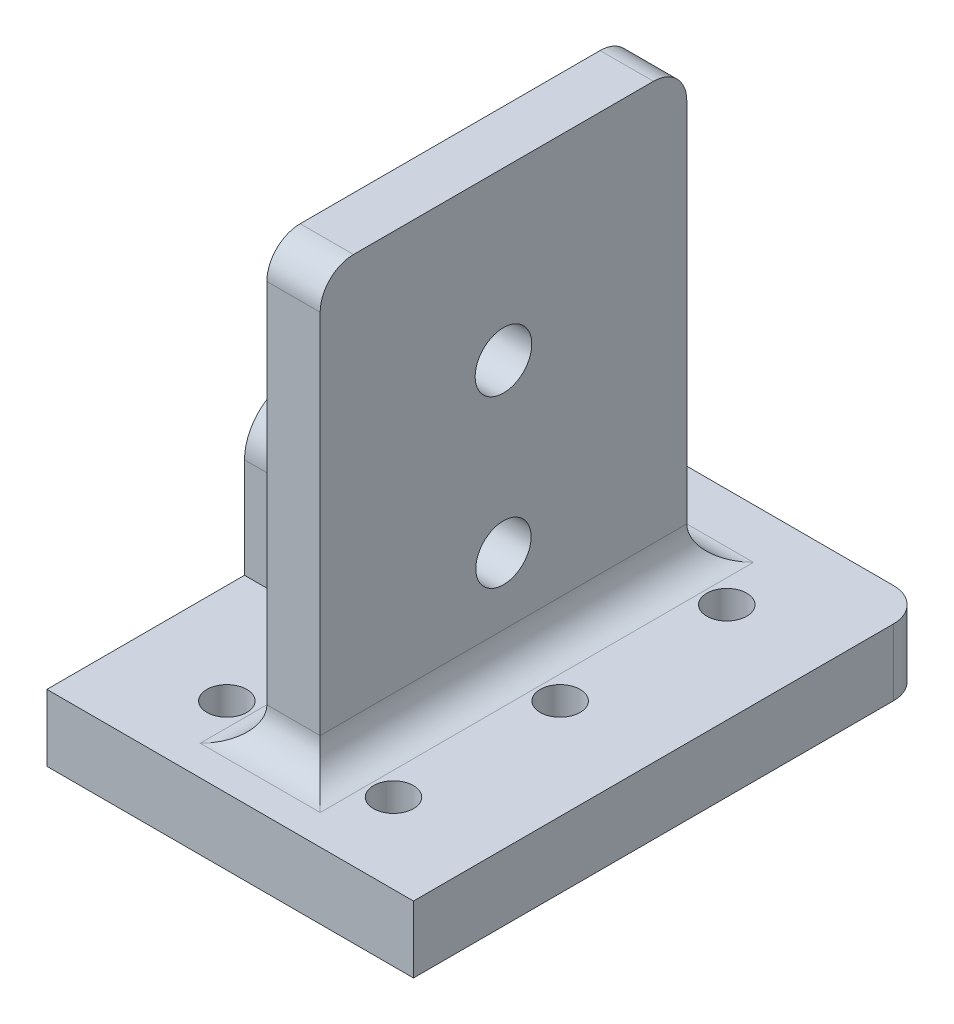
ISO-10303-21;
HEADER;
FILE_DESCRIPTION(('STEP AP214'),'2;1');
FILE_NAME('part.step','',(''),(''),'','','');
FILE_SCHEMA(('AUTOMOTIVE_DESIGN { 1 0 10303 214 1 1 1 1 }'));
ENDSEC;
DATA;
#1=APPLICATION_CONTEXT('core data for automotive mechanical design processes');
#2=APPLICATION_PROTOCOL_DEFINITION('international standard','automotive_design',2000,#1);
#3=PRODUCT_CONTEXT('',#1,'mechanical');
#4=PRODUCT('Part','Part','',(#3));
#5=PRODUCT_RELATED_PRODUCT_CATEGORY('part','',(#4));
#6=PRODUCT_DEFINITION_FORMATION('','',#4);
#7=PRODUCT_DEFINITION_CONTEXT('part definition',#1,'design');
#8=PRODUCT_DEFINITION('design','',#6,#7);
#9=PRODUCT_DEFINITION_SHAPE('','',#8);
#10=(LENGTH_UNIT() NAMED_UNIT(*) SI_UNIT(.MILLI.,.METRE.));
#11=(NAMED_UNIT(*) PLANE_ANGLE_UNIT() SI_UNIT($,.RADIAN.));
#12=(NAMED_UNIT(*) SI_UNIT($,.STERADIAN.) SOLID_ANGLE_UNIT());
#13=UNCERTAINTY_MEASURE_WITH_UNIT(LENGTH_MEASURE(1.E-05),#10,'distance_accuracy_value','');
#14=(GEOMETRIC_REPRESENTATION_CONTEXT(3) GLOBAL_UNCERTAINTY_ASSIGNED_CONTEXT((#13)) GLOBAL_UNIT_ASSIGNED_CONTEXT((#10,
#11,#12)) REPRESENTATION_CONTEXT('',''));
#15=CARTESIAN_POINT('',(0.,0.,0.));
#16=DIRECTION('',(0.,0.,1.));
#17=DIRECTION('',(1.,0.,0.));
#18=AXIS2_PLACEMENT_3D('',#15,#16,#17);
#19=CARTESIAN_POINT('',(0.,10.,0.));
#20=DIRECTION('',(0.,1.,0.));
#21=DIRECTION('',(0.,0.,1.));
#22=AXIS2_PLACEMENT_3D('',#19,#20,#21);
#23=PLANE('',#22);
#24=CARTESIAN_POINT('',(-12.5,9.99999999999999,25.));
#25=DIRECTION('',(0.,1.,0.));
#26=DIRECTION('',(0.,0.,1.));
#27=AXIS2_PLACEMENT_3D('',#24,#25,#26);
#28=CIRCLE('',#27,3.);
#29=CARTESIAN_POINT('',(-12.5,9.99999999999999,28.));
#30=VERTEX_POINT('',#29);
#31=EDGE_CURVE('E247',#30,#30,#28,.F.);
#32=ORIENTED_EDGE('',*,*,#31,.T.);
#33=EDGE_LOOP('',(#32));
#34=FACE_BOUND('',#33,.T.);
#35=CARTESIAN_POINT('',(-12.5,9.99999999999999,-25.));
#36=DIRECTION('',(0.,1.,0.));
#37=DIRECTION('',(0.,0.,1.));
#38=AXIS2_PLACEMENT_3D('',#35,#36,#37);
#39=CIRCLE('',#38,3.);
#40=CARTESIAN_POINT('',(-12.5,9.99999999999999,-22.));
#41=VERTEX_POINT('',#40);
#42=EDGE_CURVE('E242',#41,#41,#39,.F.);
#43=ORIENTED_EDGE('',*,*,#42,.T.);
#44=EDGE_LOOP('',(#43));
#45=FACE_BOUND('',#44,.T.);
#46=CARTESIAN_POINT('',(12.5,9.99999999999999,-25.));
#47=DIRECTION('',(0.,1.,0.));
#48=DIRECTION('',(0.,0.,1.));
#49=AXIS2_PLACEMENT_3D('',#46,#47,#48);
#50=CIRCLE('',#49,3.);
#51=CARTESIAN_POINT('',(12.5,9.99999999999999,-22.));
#52=VERTEX_POINT('',#51);
#53=EDGE_CURVE('E382',#52,#52,#50,.T.);
#54=ORIENTED_EDGE('',*,*,#53,.F.);
#55=EDGE_LOOP('',(#54));
#56=FACE_BOUND('',#55,.T.);
#57=CARTESIAN_POINT('',(12.5,9.99999999999999,0.));
#58=DIRECTION('',(0.,1.,0.));
#59=DIRECTION('',(0.,0.,1.));
#60=AXIS2_PLACEMENT_3D('',#57,#58,#59);
#61=CIRCLE('',#60,3.);
#62=CARTESIAN_POINT('',(12.5,9.99999999999999,2.99999999999999));
#63=VERTEX_POINT('',#62);
#64=EDGE_CURVE('E385',#63,#63,#61,.T.);
#65=ORIENTED_EDGE('',*,*,#64,.F.);
#66=EDGE_LOOP('',(#65));
#67=FACE_BOUND('',#66,.T.);
#68=CARTESIAN_POINT('',(12.5,9.99999999999999,25.));
#69=DIRECTION('',(0.,1.,0.));
#70=DIRECTION('',(0.,0.,1.));
#71=AXIS2_PLACEMENT_3D('',#68,#69,#70);
#72=CIRCLE('',#71,3.);
#73=CARTESIAN_POINT('',(12.5,9.99999999999999,28.));
#74=VERTEX_POINT('',#73);
#75=EDGE_CURVE('E237',#74,#74,#72,.T.);
#76=ORIENTED_EDGE('',*,*,#75,.F.);
#77=EDGE_LOOP('',(#76));
#78=FACE_BOUND('',#77,.T.);
#79=DIRECTION('',(0.,0.,1.));
#80=VECTOR('',#79,1.);
#81=CARTESIAN_POINT('',(-27.5,10.,-40.));
#82=LINE('',#81,#80);
#83=CARTESIAN_POINT('',(-27.5,10.,-35.));
#84=VERTEX_POINT('',#83);
#85=CARTESIAN_POINT('',(-27.5,10.,-7.35));
#86=VERTEX_POINT('',#85);
#87=EDGE_CURVE('E67',#84,#86,#82,.T.);
#88=ORIENTED_EDGE('',*,*,#87,.T.);
#89=DIRECTION('',(1.,0.,0.));
#90=VECTOR('',#89,1.);
#91=CARTESIAN_POINT('',(0.,10.,-7.35));
#92=LINE('',#91,#90);
#93=CARTESIAN_POINT('',(-9.,10.,-7.35));
#94=VERTEX_POINT('',#93);
#95=EDGE_CURVE('E213',#86,#94,#92,.T.);
#96=ORIENTED_EDGE('',*,*,#95,.T.);
#97=DIRECTION('',(0.,0.,1.));
#98=VECTOR('',#97,1.);
#99=CARTESIAN_POINT('',(-9.,10.,0.));
#100=LINE('',#99,#98);
#101=CARTESIAN_POINT('',(-9.00000000000001,10.,-32.5));
#102=VERTEX_POINT('',#101);
#103=EDGE_CURVE('E307',#94,#102,#100,.F.);
#104=ORIENTED_EDGE('',*,*,#103,.T.);
#105=DIRECTION('',(-1.,0.,0.));
#106=VECTOR('',#105,1.);
#107=CARTESIAN_POINT('',(0.,10.,-32.5));
#108=LINE('',#107,#106);
#109=CARTESIAN_POINT('',(9.,10.,-32.5));
#110=VERTEX_POINT('',#109);
#111=EDGE_CURVE('E312',#102,#110,#108,.F.);
#112=ORIENTED_EDGE('',*,*,#111,.T.);
#113=DIRECTION('',(0.,0.,-1.));
#114=VECTOR('',#113,1.);
#115=CARTESIAN_POINT('',(9.,10.,0.));
#116=LINE('',#115,#114);
#117=CARTESIAN_POINT('',(9.,10.,32.5));
#118=VERTEX_POINT('',#117);
#119=EDGE_CURVE('E315',#110,#118,#116,.F.);
#120=ORIENTED_EDGE('',*,*,#119,.T.);
#121=DIRECTION('',(1.,0.,0.));
#122=VECTOR('',#121,1.);
#123=CARTESIAN_POINT('',(0.,10.,32.5));
#124=LINE('',#123,#122);
#125=CARTESIAN_POINT('',(-9.,10.,32.5));
#126=VERTEX_POINT('',#125);
#127=EDGE_CURVE('E310',#118,#126,#124,.F.);
#128=ORIENTED_EDGE('',*,*,#127,.T.);
#129=CARTESIAN_POINT('',(-9.,10.,7.35000000000001));
#130=VERTEX_POINT('',#129);
#131=EDGE_CURVE('E308',#126,#130,#100,.F.);
#132=ORIENTED_EDGE('',*,*,#131,.T.);
#133=DIRECTION('',(-1.,0.,0.));
#134=VECTOR('',#133,1.);
#135=CARTESIAN_POINT('',(0.,10.,7.35));
#136=LINE('',#135,#134);
#137=CARTESIAN_POINT('',(-27.5,10.,7.35));
#138=VERTEX_POINT('',#137);
#139=EDGE_CURVE('E60',#130,#138,#136,.T.);
#140=ORIENTED_EDGE('',*,*,#139,.T.);
#141=CARTESIAN_POINT('',(-27.5,10.,37.));
#142=VERTEX_POINT('',#141);
#143=EDGE_CURVE('E184',#138,#142,#82,.T.);
#144=ORIENTED_EDGE('',*,*,#143,.T.);
#145=DIRECTION('',(-1.,0.,0.));
#146=VECTOR('',#145,1.);
#147=CARTESIAN_POINT('',(12.5,10.,37.));
#148=LINE('',#147,#146);
#149=CARTESIAN_POINT('',(27.5,10.,37.));
#150=VERTEX_POINT('',#149);
#151=EDGE_CURVE('E215',#150,#142,#148,.T.);
#152=ORIENTED_EDGE('',*,*,#151,.F.);
#153=DIRECTION('',(0.,0.,-1.));
#154=VECTOR('',#153,1.);
#155=CARTESIAN_POINT('',(27.5,10.,-40.));
#156=LINE('',#155,#154);
#157=CARTESIAN_POINT('',(27.5,10.,-35.));
#158=VERTEX_POINT('',#157);
#159=EDGE_CURVE('E271',#150,#158,#156,.T.);
#160=ORIENTED_EDGE('',*,*,#159,.T.);
#161=CARTESIAN_POINT('',(22.5,10.,-35.));
#162=DIRECTION('',(0.,1.,0.));
#163=DIRECTION('',(0.,0.,1.));
#164=AXIS2_PLACEMENT_3D('',#161,#162,#163);
#165=CIRCLE('',#164,5.);
#166=CARTESIAN_POINT('',(22.5,10.,-40.));
#167=VERTEX_POINT('',#166);
#168=EDGE_CURVE('E303',#158,#167,#165,.T.);
#169=ORIENTED_EDGE('',*,*,#168,.T.);
#170=DIRECTION('',(-1.,0.,0.));
#171=VECTOR('',#170,1.);
#172=CARTESIAN_POINT('',(-27.5,10.,-40.));
#173=LINE('',#172,#171);
#174=CARTESIAN_POINT('',(-22.5,10.,-40.));
#175=VERTEX_POINT('',#174);
#176=EDGE_CURVE('E273',#167,#175,#173,.T.);
#177=ORIENTED_EDGE('',*,*,#176,.T.);
#178=CARTESIAN_POINT('',(-22.5,10.,-35.));
#179=DIRECTION('',(0.,1.,0.));
#180=DIRECTION('',(0.,0.,1.));
#181=AXIS2_PLACEMENT_3D('',#178,#179,#180);
#182=CIRCLE('',#181,5.);
#183=EDGE_CURVE('E305',#175,#84,#182,.T.);
#184=ORIENTED_EDGE('',*,*,#183,.T.);
#185=EDGE_LOOP('',(#88,#96,#104,#112,#120,#128,#132,#140,#144,#152,#160,#169,#177,#184));
#186=FACE_BOUND('',#185,.T.);
#187=ADVANCED_FACE('F44',(#34,#45,#56,#67,#78,#186),#23,.T.);
#188=CARTESIAN_POINT('',(-9.00000000000001,15.,-27.5));
#189=DIRECTION('',(0.,0.,1.));
#190=DIRECTION('',(1.,0.,0.));
#191=AXIS2_PLACEMENT_3D('',#188,#189,#190);
#192=CYLINDRICAL_SURFACE('',#191,5.);
#193=CARTESIAN_POINT('',(-9.,15.,-7.35));
#194=DIRECTION('',(0.,0.,1.));
#195=DIRECTION('',(1.,0.,0.));
#196=AXIS2_PLACEMENT_3D('',#193,#194,#195);
#197=CIRCLE('',#196,5.);
#198=CARTESIAN_POINT('',(-4.,15.,-7.35));
#199=VERTEX_POINT('',#198);
#200=EDGE_CURVE('E13',#199,#94,#197,.F.);
#201=ORIENTED_EDGE('',*,*,#200,.F.);
#202=DIRECTION('',(0.,0.,1.));
#203=VECTOR('',#202,1.);
#204=CARTESIAN_POINT('',(-4.,15.,-27.5));
#205=LINE('',#204,#203);
#206=CARTESIAN_POINT('',(-4.,15.,-27.5));
#207=VERTEX_POINT('',#206);
#208=EDGE_CURVE('E332',#207,#199,#205,.T.);
#209=ORIENTED_EDGE('',*,*,#208,.F.);
#210=CARTESIAN_POINT('',(-9.00000000000001,15.,-32.5));
#211=DIRECTION('',(-0.707106781186547,0.,0.707106781186548));
#212=DIRECTION('',(0.707106781186548,0.,0.707106781186547));
#213=AXIS2_PLACEMENT_3D('',#210,#211,#212);
#214=ELLIPSE('',#213,7.07106781186548,5.);
#215=EDGE_CURVE('E250',#102,#207,#214,.T.);
#216=ORIENTED_EDGE('',*,*,#215,.F.);
#217=ORIENTED_EDGE('',*,*,#103,.F.);
#218=EDGE_LOOP('',(#201,#209,#216,#217));
#219=FACE_BOUND('',#218,.T.);
#220=ADVANCED_FACE('F469',(#219),#192,.F.);
#221=CARTESIAN_POINT('',(-9.,15.,7.35000000000001));
#222=DIRECTION('',(0.,0.,-1.));
#223=DIRECTION('',(-1.,0.,0.));
#224=AXIS2_PLACEMENT_3D('',#221,#222,#223);
#225=CIRCLE('',#224,5.);
#226=CARTESIAN_POINT('',(-4.,15.,7.35));
#227=VERTEX_POINT('',#226);
#228=EDGE_CURVE('E53',#130,#227,#225,.F.);
#229=ORIENTED_EDGE('',*,*,#228,.F.);
#230=ORIENTED_EDGE('',*,*,#131,.F.);
#231=CARTESIAN_POINT('',(-9.,15.,32.5));
#232=DIRECTION('',(0.707106781186548,0.,0.707106781186547));
#233=DIRECTION('',(-0.707106781186547,0.,0.707106781186548));
#234=AXIS2_PLACEMENT_3D('',#231,#232,#233);
#235=ELLIPSE('',#234,7.07106781186547,5.);
#236=CARTESIAN_POINT('',(-4.,15.,27.5));
#237=VERTEX_POINT('',#236);
#238=EDGE_CURVE('E361',#126,#237,#235,.T.);
#239=ORIENTED_EDGE('',*,*,#238,.T.);
#240=EDGE_CURVE('E331',#227,#237,#205,.T.);
#241=ORIENTED_EDGE('',*,*,#240,.F.);
#242=EDGE_LOOP('',(#229,#230,#239,#241));
#243=FACE_BOUND('',#242,.T.);
#244=ADVANCED_FACE('F394',(#243),#192,.F.);
#245=CARTESIAN_POINT('',(12.5,-45.,-25.));
#246=DIRECTION('',(0.,1.,0.));
#247=DIRECTION('',(0.,0.,1.));
#248=AXIS2_PLACEMENT_3D('',#245,#246,#247);
#249=CYLINDRICAL_SURFACE('',#248,1.65);
#250=CARTESIAN_POINT('',(12.5,0.,-25.));
#251=DIRECTION('',(0.,1.,0.));
#252=DIRECTION('',(0.,0.,1.));
#253=AXIS2_PLACEMENT_3D('',#250,#251,#252);
#254=CIRCLE('',#253,1.65);
#255=CARTESIAN_POINT('',(12.5,0.,-23.35));
#256=VERTEX_POINT('',#255);
#257=EDGE_CURVE('E270',#256,#256,#254,.F.);
#258=ORIENTED_EDGE('',*,*,#257,.T.);
#259=EDGE_LOOP('',(#258));
#260=FACE_BOUND('',#259,.T.);
#261=CARTESIAN_POINT('',(12.5,5.,-25.));
#262=DIRECTION('',(0.,1.,0.));
#263=DIRECTION('',(0.,0.,1.));
#264=AXIS2_PLACEMENT_3D('',#261,#262,#263);
#265=CIRCLE('',#264,1.65);
#266=CARTESIAN_POINT('',(12.5,5.,-23.35));
#267=VERTEX_POINT('',#266);
#268=EDGE_CURVE('E379',#267,#267,#265,.T.);
#269=ORIENTED_EDGE('',*,*,#268,.T.);
#270=EDGE_LOOP('',(#269));
#271=FACE_BOUND('',#270,.T.);
#272=ADVANCED_FACE('F548',(#260,#271),#249,.F.);
#273=CARTESIAN_POINT('',(12.5,-45.,0.));
#274=DIRECTION('',(0.,1.,0.));
#275=DIRECTION('',(0.,0.,1.));
#276=AXIS2_PLACEMENT_3D('',#273,#274,#275);
#277=CYLINDRICAL_SURFACE('',#276,1.65);
#278=CARTESIAN_POINT('',(12.5,0.,0.));
#279=DIRECTION('',(0.,1.,0.));
#280=DIRECTION('',(0.,0.,1.));
#281=AXIS2_PLACEMENT_3D('',#278,#279,#280);
#282=CIRCLE('',#281,1.65);
#283=CARTESIAN_POINT('',(12.5,0.,1.64999999999999));
#284=VERTEX_POINT('',#283);
#285=EDGE_CURVE('E294',#284,#284,#282,.F.);
#286=ORIENTED_EDGE('',*,*,#285,.T.);
#287=EDGE_LOOP('',(#286));
#288=FACE_BOUND('',#287,.T.);
#289=CARTESIAN_POINT('',(12.5,5.,0.));
#290=DIRECTION('',(0.,1.,0.));
#291=DIRECTION('',(0.,0.,1.));
#292=AXIS2_PLACEMENT_3D('',#289,#290,#291);
#293=CIRCLE('',#292,1.65);
#294=CARTESIAN_POINT('',(12.5,5.,1.64999999999999));
#295=VERTEX_POINT('',#294);
#296=EDGE_CURVE('E376',#295,#295,#293,.T.);
#297=ORIENTED_EDGE('',*,*,#296,.T.);
#298=EDGE_LOOP('',(#297));
#299=FACE_BOUND('',#298,.T.);
#300=ADVANCED_FACE('F545',(#288,#299),#277,.F.);
#301=CARTESIAN_POINT('',(12.5,-45.,25.));
#302=DIRECTION('',(0.,1.,0.));
#303=DIRECTION('',(0.,0.,1.));
#304=AXIS2_PLACEMENT_3D('',#301,#302,#303);
#305=CYLINDRICAL_SURFACE('',#304,1.65);
#306=CARTESIAN_POINT('',(12.5,0.,25.));
#307=DIRECTION('',(0.,1.,0.));
#308=DIRECTION('',(0.,0.,1.));
#309=AXIS2_PLACEMENT_3D('',#306,#307,#308);
#310=CIRCLE('',#309,1.65);
#311=CARTESIAN_POINT('',(12.5,0.,26.65));
#312=VERTEX_POINT('',#311);
#313=EDGE_CURVE('E288',#312,#312,#310,.F.);
#314=ORIENTED_EDGE('',*,*,#313,.T.);
#315=EDGE_LOOP('',(#314));
#316=FACE_BOUND('',#315,.T.);
#317=CARTESIAN_POINT('',(12.5,5.,25.));
#318=DIRECTION('',(0.,1.,0.));
#319=DIRECTION('',(0.,0.,1.));
#320=AXIS2_PLACEMENT_3D('',#317,#318,#319);
#321=CIRCLE('',#320,1.65);
#322=CARTESIAN_POINT('',(12.5,5.,26.65));
#323=VERTEX_POINT('',#322);
#324=EDGE_CURVE('E227',#323,#323,#321,.T.);
#325=ORIENTED_EDGE('',*,*,#324,.T.);
#326=EDGE_LOOP('',(#325));
#327=FACE_BOUND('',#326,.T.);
#328=ADVANCED_FACE('F493',(#316,#327),#305,.F.);
#329=CARTESIAN_POINT('',(-12.5,-45.,-25.));
#330=DIRECTION('',(0.,1.,0.));
#331=DIRECTION('',(0.,0.,1.));
#332=AXIS2_PLACEMENT_3D('',#329,#330,#331);
#333=CYLINDRICAL_SURFACE('',#332,1.65);
#334=CARTESIAN_POINT('',(-12.5,0.,-25.));
#335=DIRECTION('',(0.,1.,0.));
#336=DIRECTION('',(0.,0.,1.));
#337=AXIS2_PLACEMENT_3D('',#334,#335,#336);
#338=CIRCLE('',#337,1.65);
#339=CARTESIAN_POINT('',(-12.5,0.,-23.35));
#340=VERTEX_POINT('',#339);
#341=EDGE_CURVE('E278',#340,#340,#338,.T.);
#342=ORIENTED_EDGE('',*,*,#341,.F.);
#343=EDGE_LOOP('',(#342));
#344=FACE_BOUND('',#343,.T.);
#345=CARTESIAN_POINT('',(-12.5,5.,-25.));
#346=DIRECTION('',(0.,1.,0.));
#347=DIRECTION('',(0.,0.,1.));
#348=AXIS2_PLACEMENT_3D('',#345,#346,#347);
#349=CIRCLE('',#348,1.65);
#350=CARTESIAN_POINT('',(-12.5,5.,-23.35));
#351=VERTEX_POINT('',#350);
#352=EDGE_CURVE('E236',#351,#351,#349,.F.);
#353=ORIENTED_EDGE('',*,*,#352,.F.);
#354=EDGE_LOOP('',(#353));
#355=FACE_BOUND('',#354,.T.);
#356=ADVANCED_FACE('F490',(#344,#355),#333,.F.);
#357=CARTESIAN_POINT('',(-12.5,-45.,25.));
#358=DIRECTION('',(0.,1.,0.));
#359=DIRECTION('',(0.,0.,1.));
#360=AXIS2_PLACEMENT_3D('',#357,#358,#359);
#361=CYLINDRICAL_SURFACE('',#360,1.65);
#362=CARTESIAN_POINT('',(-12.5,0.,25.));
#363=DIRECTION('',(0.,1.,0.));
#364=DIRECTION('',(0.,0.,1.));
#365=AXIS2_PLACEMENT_3D('',#362,#363,#364);
#366=CIRCLE('',#365,1.65);
#367=CARTESIAN_POINT('',(-12.5,0.,26.65));
#368=VERTEX_POINT('',#367);
#369=EDGE_CURVE('E282',#368,#368,#366,.T.);
#370=ORIENTED_EDGE('',*,*,#369,.F.);
#371=EDGE_LOOP('',(#370));
#372=FACE_BOUND('',#371,.T.);
#373=CARTESIAN_POINT('',(-12.5,5.,25.));
#374=DIRECTION('',(0.,1.,0.));
#375=DIRECTION('',(0.,0.,1.));
#376=AXIS2_PLACEMENT_3D('',#373,#374,#375);
#377=CIRCLE('',#376,1.65);
#378=CARTESIAN_POINT('',(-12.5,5.,26.65));
#379=VERTEX_POINT('',#378);
#380=EDGE_CURVE('E241',#379,#379,#377,.F.);
#381=ORIENTED_EDGE('',*,*,#380,.F.);
#382=EDGE_LOOP('',(#381));
#383=FACE_BOUND('',#382,.T.);
#384=ADVANCED_FACE('F480',(#372,#383),#361,.F.);
#385=CARTESIAN_POINT('',(27.5,10.,-40.));
#386=DIRECTION('',(-1.,0.,0.));
#387=DIRECTION('',(0.,0.,1.));
#388=AXIS2_PLACEMENT_3D('',#385,#386,#387);
#389=PLANE('',#388);
#390=ORIENTED_EDGE('',*,*,#159,.F.);
#391=DIRECTION('',(0.,-1.,0.));
#392=VECTOR('',#391,1.);
#393=CARTESIAN_POINT('',(27.5,10.,37.));
#394=LINE('',#393,#392);
#395=CARTESIAN_POINT('',(27.5,0.,37.));
#396=VERTEX_POINT('',#395);
#397=EDGE_CURVE('E220',#150,#396,#394,.T.);
#398=ORIENTED_EDGE('',*,*,#397,.T.);
#399=DIRECTION('',(0.,0.,-1.));
#400=VECTOR('',#399,1.);
#401=CARTESIAN_POINT('',(27.5,0.,-40.));
#402=LINE('',#401,#400);
#403=CARTESIAN_POINT('',(27.5,0.,-35.));
#404=VERTEX_POINT('',#403);
#405=EDGE_CURVE('E279',#396,#404,#402,.T.);
#406=ORIENTED_EDGE('',*,*,#405,.T.);
#407=DIRECTION('',(0.,-1.,0.));
#408=VECTOR('',#407,1.);
#409=CARTESIAN_POINT('',(27.5,10.,-35.));
#410=LINE('',#409,#408);
#411=EDGE_CURVE('E354',#404,#158,#410,.F.);
#412=ORIENTED_EDGE('',*,*,#411,.T.);
#413=EDGE_LOOP('',(#390,#398,#406,#412));
#414=FACE_BOUND('',#413,.T.);
#415=ADVANCED_FACE('F449',(#414),#389,.F.);
#416=CARTESIAN_POINT('',(-27.5,10.,-40.));
#417=DIRECTION('',(0.,0.,1.));
#418=DIRECTION('',(1.,0.,0.));
#419=AXIS2_PLACEMENT_3D('',#416,#417,#418);
#420=PLANE('',#419);
#421=DIRECTION('',(-1.,0.,0.));
#422=VECTOR('',#421,1.);
#423=CARTESIAN_POINT('',(-27.5,0.,-40.));
#424=LINE('',#423,#422);
#425=CARTESIAN_POINT('',(22.5,0.,-40.));
#426=VERTEX_POINT('',#425);
#427=CARTESIAN_POINT('',(-22.5,0.,-40.));
#428=VERTEX_POINT('',#427);
#429=EDGE_CURVE('E281',#426,#428,#424,.T.);
#430=ORIENTED_EDGE('',*,*,#429,.T.);
#431=DIRECTION('',(0.,-1.,0.));
#432=VECTOR('',#431,1.);
#433=CARTESIAN_POINT('',(-22.5,10.,-40.));
#434=LINE('',#433,#432);
#435=EDGE_CURVE('E352',#428,#175,#434,.F.);
#436=ORIENTED_EDGE('',*,*,#435,.T.);
#437=ORIENTED_EDGE('',*,*,#176,.F.);
#438=DIRECTION('',(0.,-1.,0.));
#439=VECTOR('',#438,1.);
#440=CARTESIAN_POINT('',(22.5,10.,-40.));
#441=LINE('',#440,#439);
#442=EDGE_CURVE('E349',#167,#426,#441,.T.);
#443=ORIENTED_EDGE('',*,*,#442,.T.);
#444=EDGE_LOOP('',(#430,#436,#437,#443));
#445=FACE_BOUND('',#444,.T.);
#446=ADVANCED_FACE('F440',(#445),#420,.F.);
#447=CARTESIAN_POINT('',(-27.5,10.,-40.));
#448=DIRECTION('',(1.,0.,0.));
#449=DIRECTION('',(0.,0.,-1.));
#450=AXIS2_PLACEMENT_3D('',#447,#448,#449);
#451=PLANE('',#450);
#452=ORIENTED_EDGE('',*,*,#143,.F.);
#453=DIRECTION('',(0.,-1.,0.));
#454=VECTOR('',#453,1.);
#455=CARTESIAN_POINT('',(-27.5,0.,7.35000000000001));
#456=LINE('',#455,#454);
#457=CARTESIAN_POINT('',(-27.5,25.,7.35));
#458=VERTEX_POINT('',#457);
#459=EDGE_CURVE('E176',#458,#138,#456,.T.);
#460=ORIENTED_EDGE('',*,*,#459,.F.);
#461=CARTESIAN_POINT('',(-27.5,25.,0.));
#462=DIRECTION('',(1.,0.,0.));
#463=DIRECTION('',(0.,0.,-1.));
#464=AXIS2_PLACEMENT_3D('',#461,#462,#463);
#465=CIRCLE('',#464,7.35);
#466=CARTESIAN_POINT('',(-27.5,25.,-7.35));
#467=VERTEX_POINT('',#466);
#468=EDGE_CURVE('E181',#467,#458,#465,.T.);
#469=ORIENTED_EDGE('',*,*,#468,.F.);
#470=DIRECTION('',(0.,1.,0.));
#471=VECTOR('',#470,1.);
#472=CARTESIAN_POINT('',(-27.5,25.,-7.35));
#473=LINE('',#472,#471);
#474=EDGE_CURVE('E204',#86,#467,#473,.T.);
#475=ORIENTED_EDGE('',*,*,#474,.F.);
#476=ORIENTED_EDGE('',*,*,#87,.F.);
#477=DIRECTION('',(0.,-1.,0.));
#478=VECTOR('',#477,1.);
#479=CARTESIAN_POINT('',(-27.5,10.,-35.));
#480=LINE('',#479,#478);
#481=CARTESIAN_POINT('',(-27.5,0.,-35.));
#482=VERTEX_POINT('',#481);
#483=EDGE_CURVE('E341',#84,#482,#480,.T.);
#484=ORIENTED_EDGE('',*,*,#483,.T.);
#485=DIRECTION('',(0.,0.,1.));
#486=VECTOR('',#485,1.);
#487=CARTESIAN_POINT('',(-27.5,0.,-40.));
#488=LINE('',#487,#486);
#489=CARTESIAN_POINT('',(-27.5,0.,37.));
#490=VERTEX_POINT('',#489);
#491=EDGE_CURVE('E274',#482,#490,#488,.T.);
#492=ORIENTED_EDGE('',*,*,#491,.T.);
#493=DIRECTION('',(0.,1.,0.));
#494=VECTOR('',#493,1.);
#495=CARTESIAN_POINT('',(-27.5,10.,37.));
#496=LINE('',#495,#494);
#497=EDGE_CURVE('E218',#490,#142,#496,.T.);
#498=ORIENTED_EDGE('',*,*,#497,.T.);
#499=EDGE_LOOP('',(#452,#460,#469,#475,#476,#484,#492,#498));
#500=FACE_BOUND('',#499,.T.);
#501=CARTESIAN_POINT('',(-27.5,25.,0.));
#502=DIRECTION('',(1.,0.,0.));
#503=DIRECTION('',(0.,0.,-1.));
#504=AXIS2_PLACEMENT_3D('',#501,#502,#503);
#505=CIRCLE('',#504,4.15);
#506=CARTESIAN_POINT('',(-27.5,25.,-4.15));
#507=VERTEX_POINT('',#506);
#508=EDGE_CURVE('E209',#507,#507,#505,.T.);
#509=ORIENTED_EDGE('',*,*,#508,.T.);
#510=EDGE_LOOP('',(#509));
#511=FACE_BOUND('',#510,.T.);
#512=ADVANCED_FACE('F178',(#500,#511),#451,.F.);
#513=CARTESIAN_POINT('',(0.,0.,0.));
#514=DIRECTION('',(0.,1.,0.));
#515=DIRECTION('',(0.,0.,1.));
#516=AXIS2_PLACEMENT_3D('',#513,#514,#515);
#517=PLANE('',#516);
#518=DIRECTION('',(-1.,0.,0.));
#519=VECTOR('',#518,1.);
#520=CARTESIAN_POINT('',(0.,0.,37.));
#521=LINE('',#520,#519);
#522=EDGE_CURVE('E357',#396,#490,#521,.T.);
#523=ORIENTED_EDGE('',*,*,#522,.T.);
#524=ORIENTED_EDGE('',*,*,#491,.F.);
#525=CARTESIAN_POINT('',(-22.5,0.,-35.));
#526=DIRECTION('',(0.,1.,0.));
#527=DIRECTION('',(0.,0.,1.));
#528=AXIS2_PLACEMENT_3D('',#525,#526,#527);
#529=CIRCLE('',#528,5.);
#530=EDGE_CURVE('E347',#482,#428,#529,.F.);
#531=ORIENTED_EDGE('',*,*,#530,.T.);
#532=ORIENTED_EDGE('',*,*,#429,.F.);
#533=CARTESIAN_POINT('',(22.5,0.,-35.));
#534=DIRECTION('',(0.,1.,0.));
#535=DIRECTION('',(0.,0.,1.));
#536=AXIS2_PLACEMENT_3D('',#533,#534,#535);
#537=CIRCLE('',#536,5.);
#538=EDGE_CURVE('E344',#426,#404,#537,.F.);
#539=ORIENTED_EDGE('',*,*,#538,.T.);
#540=ORIENTED_EDGE('',*,*,#405,.F.);
#541=EDGE_LOOP('',(#523,#524,#531,#532,#539,#540));
#542=FACE_BOUND('',#541,.T.);
#543=ORIENTED_EDGE('',*,*,#341,.T.);
#544=EDGE_LOOP('',(#543));
#545=FACE_BOUND('',#544,.T.);
#546=ORIENTED_EDGE('',*,*,#369,.T.);
#547=EDGE_LOOP('',(#546));
#548=FACE_BOUND('',#547,.T.);
#549=ORIENTED_EDGE('',*,*,#257,.F.);
#550=EDGE_LOOP('',(#549));
#551=FACE_BOUND('',#550,.T.);
#552=ORIENTED_EDGE('',*,*,#285,.F.);
#553=EDGE_LOOP('',(#552));
#554=FACE_BOUND('',#553,.T.);
#555=ORIENTED_EDGE('',*,*,#313,.F.);
#556=EDGE_LOOP('',(#555));
#557=FACE_BOUND('',#556,.T.);
#558=ADVANCED_FACE('F437',(#542,#545,#548,#551,#554,#557),#517,.F.);
#559=CARTESIAN_POINT('',(4.,75.,-27.5));
#560=DIRECTION('',(-1.,0.,0.));
#561=DIRECTION('',(0.,0.,1.));
#562=AXIS2_PLACEMENT_3D('',#559,#560,#561);
#563=PLANE('',#562);
#564=CARTESIAN_POINT('',(4.,25.,0.));
#565=DIRECTION('',(-1.,0.,0.));
#566=DIRECTION('',(0.,0.,1.));
#567=AXIS2_PLACEMENT_3D('',#564,#565,#566);
#568=CIRCLE('',#567,4.15);
#569=CARTESIAN_POINT('',(4.,25.,4.15));
#570=VERTEX_POINT('',#569);
#571=EDGE_CURVE('E48',#570,#570,#568,.T.);
#572=ORIENTED_EDGE('',*,*,#571,.T.);
#573=EDGE_LOOP('',(#572));
#574=FACE_BOUND('',#573,.T.);
#575=CARTESIAN_POINT('',(4.,50.,0.));
#576=DIRECTION('',(-1.,0.,0.));
#577=DIRECTION('',(0.,0.,1.));
#578=AXIS2_PLACEMENT_3D('',#575,#576,#577);
#579=CIRCLE('',#578,4.25);
#580=CARTESIAN_POINT('',(4.,50.,4.25000000000001));
#581=VERTEX_POINT('',#580);
#582=EDGE_CURVE('E246',#581,#581,#579,.T.);
#583=ORIENTED_EDGE('',*,*,#582,.T.);
#584=EDGE_LOOP('',(#583));
#585=FACE_BOUND('',#584,.T.);
#586=DIRECTION('',(0.,-1.,0.));
#587=VECTOR('',#586,1.);
#588=CARTESIAN_POINT('',(4.,75.,27.5));
#589=LINE('',#588,#587);
#590=CARTESIAN_POINT('',(4.,70.,27.5));
#591=VERTEX_POINT('',#590);
#592=CARTESIAN_POINT('',(4.,15.,27.5));
#593=VERTEX_POINT('',#592);
#594=EDGE_CURVE('E258',#591,#593,#589,.T.);
#595=ORIENTED_EDGE('',*,*,#594,.T.);
#596=DIRECTION('',(0.,0.,-1.));
#597=VECTOR('',#596,1.);
#598=CARTESIAN_POINT('',(4.,15.,-27.5));
#599=LINE('',#598,#597);
#600=CARTESIAN_POINT('',(4.,15.,-27.5));
#601=VERTEX_POINT('',#600);
#602=EDGE_CURVE('E325',#593,#601,#599,.T.);
#603=ORIENTED_EDGE('',*,*,#602,.T.);
#604=DIRECTION('',(0.,-1.,0.));
#605=VECTOR('',#604,1.);
#606=CARTESIAN_POINT('',(4.,75.,-27.5));
#607=LINE('',#606,#605);
#608=CARTESIAN_POINT('',(4.,70.,-27.5));
#609=VERTEX_POINT('',#608);
#610=EDGE_CURVE('E267',#609,#601,#607,.T.);
#611=ORIENTED_EDGE('',*,*,#610,.F.);
#612=CARTESIAN_POINT('',(4.,70.,-22.5));
#613=DIRECTION('',(-1.,0.,0.));
#614=DIRECTION('',(0.,0.,1.));
#615=AXIS2_PLACEMENT_3D('',#612,#613,#614);
#616=CIRCLE('',#615,5.);
#617=CARTESIAN_POINT('',(4.,75.,-22.5));
#618=VERTEX_POINT('',#617);
#619=EDGE_CURVE('E323',#609,#618,#616,.F.);
#620=ORIENTED_EDGE('',*,*,#619,.T.);
#621=DIRECTION('',(0.,0.,-1.));
#622=VECTOR('',#621,1.);
#623=CARTESIAN_POINT('',(4.,75.,-27.5));
#624=LINE('',#623,#622);
#625=CARTESIAN_POINT('',(4.,75.,22.5));
#626=VERTEX_POINT('',#625);
#627=EDGE_CURVE('E251',#626,#618,#624,.T.);
#628=ORIENTED_EDGE('',*,*,#627,.F.);
#629=CARTESIAN_POINT('',(4.,70.,22.5));
#630=DIRECTION('',(-1.,0.,0.));
#631=DIRECTION('',(0.,0.,1.));
#632=AXIS2_PLACEMENT_3D('',#629,#630,#631);
#633=CIRCLE('',#632,5.);
#634=EDGE_CURVE('E321',#626,#591,#633,.F.);
#635=ORIENTED_EDGE('',*,*,#634,.T.);
#636=EDGE_LOOP('',(#595,#603,#611,#620,#628,#635));
#637=FACE_BOUND('',#636,.T.);
#638=ADVANCED_FACE('F409',(#574,#585,#637),#563,.F.);
#639=CARTESIAN_POINT('',(-4.,75.,-27.5));
#640=DIRECTION('',(0.,0.,1.));
#641=DIRECTION('',(1.,0.,0.));
#642=AXIS2_PLACEMENT_3D('',#639,#640,#641);
#643=PLANE('',#642);
#644=ORIENTED_EDGE('',*,*,#610,.T.);
#645=DIRECTION('',(-1.,0.,0.));
#646=VECTOR('',#645,1.);
#647=CARTESIAN_POINT('',(-4.,15.,-27.5));
#648=LINE('',#647,#646);
#649=EDGE_CURVE('E300',#601,#207,#648,.T.);
#650=ORIENTED_EDGE('',*,*,#649,.T.);
#651=DIRECTION('',(0.,-1.,0.));
#652=VECTOR('',#651,1.);
#653=CARTESIAN_POINT('',(-4.,75.,-27.5));
#654=LINE('',#653,#652);
#655=CARTESIAN_POINT('',(-4.,70.,-27.5));
#656=VERTEX_POINT('',#655);
#657=EDGE_CURVE('E264',#656,#207,#654,.T.);
#658=ORIENTED_EDGE('',*,*,#657,.F.);
#659=DIRECTION('',(-1.,0.,0.));
#660=VECTOR('',#659,1.);
#661=CARTESIAN_POINT('',(4.,70.,-27.5));
#662=LINE('',#661,#660);
#663=EDGE_CURVE('E291',#656,#609,#662,.F.);
#664=ORIENTED_EDGE('',*,*,#663,.T.);
#665=EDGE_LOOP('',(#644,#650,#658,#664));
#666=FACE_BOUND('',#665,.T.);
#667=ADVANCED_FACE('F536',(#666),#643,.F.);
#668=CARTESIAN_POINT('',(-4.,75.,-27.5));
#669=DIRECTION('',(1.,0.,0.));
#670=DIRECTION('',(0.,0.,-1.));
#671=AXIS2_PLACEMENT_3D('',#668,#669,#670);
#672=PLANE('',#671);
#673=DIRECTION('',(0.,-1.,0.));
#674=VECTOR('',#673,1.);
#675=CARTESIAN_POINT('',(-4.,25.,-7.35));
#676=LINE('',#675,#674);
#677=CARTESIAN_POINT('',(-4.,25.,-7.35));
#678=VERTEX_POINT('',#677);
#679=EDGE_CURVE('E188',#678,#199,#676,.T.);
#680=ORIENTED_EDGE('',*,*,#679,.F.);
#681=CARTESIAN_POINT('',(-4.,25.,0.));
#682=DIRECTION('',(-1.,0.,0.));
#683=DIRECTION('',(0.,0.,1.));
#684=AXIS2_PLACEMENT_3D('',#681,#682,#683);
#685=CIRCLE('',#684,7.35);
#686=CARTESIAN_POINT('',(-4.,25.,7.35000000000001));
#687=VERTEX_POINT('',#686);
#688=EDGE_CURVE('E202',#687,#678,#685,.T.);
#689=ORIENTED_EDGE('',*,*,#688,.F.);
#690=DIRECTION('',(0.,1.,0.));
#691=VECTOR('',#690,1.);
#692=CARTESIAN_POINT('',(-4.,0.,7.35));
#693=LINE('',#692,#691);
#694=EDGE_CURVE('E187',#227,#687,#693,.T.);
#695=ORIENTED_EDGE('',*,*,#694,.F.);
#696=ORIENTED_EDGE('',*,*,#240,.T.);
#697=DIRECTION('',(0.,-1.,0.));
#698=VECTOR('',#697,1.);
#699=CARTESIAN_POINT('',(-4.,75.,27.5));
#700=LINE('',#699,#698);
#701=CARTESIAN_POINT('',(-4.,70.,27.5));
#702=VERTEX_POINT('',#701);
#703=EDGE_CURVE('E261',#702,#237,#700,.T.);
#704=ORIENTED_EDGE('',*,*,#703,.F.);
#705=CARTESIAN_POINT('',(-4.,70.,22.5));
#706=DIRECTION('',(1.,0.,0.));
#707=DIRECTION('',(0.,0.,-1.));
#708=AXIS2_PLACEMENT_3D('',#705,#706,#707);
#709=CIRCLE('',#708,5.);
#710=CARTESIAN_POINT('',(-4.,75.,22.5));
#711=VERTEX_POINT('',#710);
#712=EDGE_CURVE('E327',#702,#711,#709,.F.);
#713=ORIENTED_EDGE('',*,*,#712,.T.);
#714=DIRECTION('',(0.,0.,1.));
#715=VECTOR('',#714,1.);
#716=CARTESIAN_POINT('',(-4.,75.,-27.5));
#717=LINE('',#716,#715);
#718=CARTESIAN_POINT('',(-4.,75.,-22.5));
#719=VERTEX_POINT('',#718);
#720=EDGE_CURVE('E254',#719,#711,#717,.T.);
#721=ORIENTED_EDGE('',*,*,#720,.F.);
#722=CARTESIAN_POINT('',(-4.,70.,-22.5));
#723=DIRECTION('',(1.,0.,0.));
#724=DIRECTION('',(0.,0.,-1.));
#725=AXIS2_PLACEMENT_3D('',#722,#723,#724);
#726=CIRCLE('',#725,5.);
#727=EDGE_CURVE('E329',#719,#656,#726,.F.);
#728=ORIENTED_EDGE('',*,*,#727,.T.);
#729=ORIENTED_EDGE('',*,*,#657,.T.);
#730=ORIENTED_EDGE('',*,*,#208,.T.);
#731=EDGE_LOOP('',(#680,#689,#695,#696,#704,#713,#721,#728,#729,#730));
#732=FACE_BOUND('',#731,.T.);
#733=CARTESIAN_POINT('',(-4.,50.,0.));
#734=DIRECTION('',(-1.,0.,0.));
#735=DIRECTION('',(0.,0.,1.));
#736=AXIS2_PLACEMENT_3D('',#733,#734,#735);
#737=CIRCLE('',#736,4.25);
#738=CARTESIAN_POINT('',(-4.,50.,4.25000000000001));
#739=VERTEX_POINT('',#738);
#740=EDGE_CURVE('E243',#739,#739,#737,.T.);
#741=ORIENTED_EDGE('',*,*,#740,.F.);
#742=EDGE_LOOP('',(#741));
#743=FACE_BOUND('',#742,.T.);
#744=ADVANCED_FACE('F421',(#732,#743),#672,.F.);
#745=CARTESIAN_POINT('',(-4.,75.,27.5));
#746=DIRECTION('',(0.,0.,-1.));
#747=DIRECTION('',(-1.,0.,0.));
#748=AXIS2_PLACEMENT_3D('',#745,#746,#747);
#749=PLANE('',#748);
#750=ORIENTED_EDGE('',*,*,#703,.T.);
#751=DIRECTION('',(1.,0.,0.));
#752=VECTOR('',#751,1.);
#753=CARTESIAN_POINT('',(-4.,15.,27.5));
#754=LINE('',#753,#752);
#755=EDGE_CURVE('E319',#237,#593,#754,.T.);
#756=ORIENTED_EDGE('',*,*,#755,.T.);
#757=ORIENTED_EDGE('',*,*,#594,.F.);
#758=DIRECTION('',(1.,0.,0.));
#759=VECTOR('',#758,1.);
#760=CARTESIAN_POINT('',(-4.,70.,27.5));
#761=LINE('',#760,#759);
#762=EDGE_CURVE('E317',#591,#702,#761,.F.);
#763=ORIENTED_EDGE('',*,*,#762,.T.);
#764=EDGE_LOOP('',(#750,#756,#757,#763));
#765=FACE_BOUND('',#764,.T.);
#766=ADVANCED_FACE('F405',(#765),#749,.F.);
#767=CARTESIAN_POINT('',(0.,75.,0.));
#768=DIRECTION('',(0.,1.,0.));
#769=DIRECTION('',(0.,0.,1.));
#770=AXIS2_PLACEMENT_3D('',#767,#768,#769);
#771=PLANE('',#770);
#772=ORIENTED_EDGE('',*,*,#627,.T.);
#773=DIRECTION('',(-1.,0.,0.));
#774=VECTOR('',#773,1.);
#775=CARTESIAN_POINT('',(-4.,75.,-22.5));
#776=LINE('',#775,#774);
#777=EDGE_CURVE('E338',#618,#719,#776,.T.);
#778=ORIENTED_EDGE('',*,*,#777,.T.);
#779=ORIENTED_EDGE('',*,*,#720,.T.);
#780=DIRECTION('',(1.,0.,0.));
#781=VECTOR('',#780,1.);
#782=CARTESIAN_POINT('',(4.,75.,22.5));
#783=LINE('',#782,#781);
#784=EDGE_CURVE('E335',#711,#626,#783,.T.);
#785=ORIENTED_EDGE('',*,*,#784,.T.);
#786=EDGE_LOOP('',(#772,#778,#779,#785));
#787=FACE_BOUND('',#786,.T.);
#788=ADVANCED_FACE('F417',(#787),#771,.T.);
#789=CARTESIAN_POINT('',(-4.,15.,32.5));
#790=DIRECTION('',(1.,0.,0.));
#791=DIRECTION('',(0.,0.,-1.));
#792=AXIS2_PLACEMENT_3D('',#789,#790,#791);
#793=CYLINDRICAL_SURFACE('',#792,5.);
#794=ORIENTED_EDGE('',*,*,#238,.F.);
#795=ORIENTED_EDGE('',*,*,#127,.F.);
#796=CARTESIAN_POINT('',(9.00000000000001,15.,32.5));
#797=DIRECTION('',(0.707106781186547,0.,-0.707106781186548));
#798=DIRECTION('',(-0.707106781186548,0.,-0.707106781186547));
#799=AXIS2_PLACEMENT_3D('',#796,#797,#798);
#800=ELLIPSE('',#799,7.07106781186548,5.);
#801=EDGE_CURVE('E255',#593,#118,#800,.F.);
#802=ORIENTED_EDGE('',*,*,#801,.F.);
#803=ORIENTED_EDGE('',*,*,#755,.F.);
#804=EDGE_LOOP('',(#794,#795,#802,#803));
#805=FACE_BOUND('',#804,.T.);
#806=ADVANCED_FACE('F401',(#805),#793,.F.);
#807=CARTESIAN_POINT('',(9.,15.,-27.5));
#808=DIRECTION('',(0.,0.,-1.));
#809=DIRECTION('',(-1.,0.,0.));
#810=AXIS2_PLACEMENT_3D('',#807,#808,#809);
#811=CYLINDRICAL_SURFACE('',#810,5.);
#812=ORIENTED_EDGE('',*,*,#801,.T.);
#813=ORIENTED_EDGE('',*,*,#119,.F.);
#814=CARTESIAN_POINT('',(9.,15.,-32.5));
#815=DIRECTION('',(-0.707106781186548,0.,-0.707106781186547));
#816=DIRECTION('',(0.707106781186547,0.,-0.707106781186548));
#817=AXIS2_PLACEMENT_3D('',#814,#815,#816);
#818=ELLIPSE('',#817,7.07106781186547,5.);
#819=EDGE_CURVE('E359',#601,#110,#818,.F.);
#820=ORIENTED_EDGE('',*,*,#819,.F.);
#821=ORIENTED_EDGE('',*,*,#602,.F.);
#822=EDGE_LOOP('',(#812,#813,#820,#821));
#823=FACE_BOUND('',#822,.T.);
#824=ADVANCED_FACE('F498',(#823),#811,.F.);
#825=CARTESIAN_POINT('',(-4.,15.,-32.5));
#826=DIRECTION('',(-1.,0.,0.));
#827=DIRECTION('',(0.,0.,1.));
#828=AXIS2_PLACEMENT_3D('',#825,#826,#827);
#829=CYLINDRICAL_SURFACE('',#828,5.);
#830=ORIENTED_EDGE('',*,*,#819,.T.);
#831=ORIENTED_EDGE('',*,*,#111,.F.);
#832=ORIENTED_EDGE('',*,*,#215,.T.);
#833=ORIENTED_EDGE('',*,*,#649,.F.);
#834=EDGE_LOOP('',(#830,#831,#832,#833));
#835=FACE_BOUND('',#834,.T.);
#836=ADVANCED_FACE('F495',(#835),#829,.F.);
#837=CARTESIAN_POINT('',(0.,70.,-22.5));
#838=DIRECTION('',(1.,0.,0.));
#839=DIRECTION('',(0.,0.,-1.));
#840=AXIS2_PLACEMENT_3D('',#837,#838,#839);
#841=CYLINDRICAL_SURFACE('',#840,5.);
#842=ORIENTED_EDGE('',*,*,#619,.F.);
#843=ORIENTED_EDGE('',*,*,#663,.F.);
#844=ORIENTED_EDGE('',*,*,#727,.F.);
#845=ORIENTED_EDGE('',*,*,#777,.F.);
#846=EDGE_LOOP('',(#842,#843,#844,#845));
#847=FACE_BOUND('',#846,.T.);
#848=ADVANCED_FACE('F497',(#847),#841,.T.);
#849=CARTESIAN_POINT('',(0.,70.,22.5));
#850=DIRECTION('',(-1.,0.,0.));
#851=DIRECTION('',(0.,0.,1.));
#852=AXIS2_PLACEMENT_3D('',#849,#850,#851);
#853=CYLINDRICAL_SURFACE('',#852,5.);
#854=ORIENTED_EDGE('',*,*,#712,.F.);
#855=ORIENTED_EDGE('',*,*,#762,.F.);
#856=ORIENTED_EDGE('',*,*,#634,.F.);
#857=ORIENTED_EDGE('',*,*,#784,.F.);
#858=EDGE_LOOP('',(#854,#855,#856,#857));
#859=FACE_BOUND('',#858,.T.);
#860=ADVANCED_FACE('F415',(#859),#853,.T.);
#861=CARTESIAN_POINT('',(-22.5,10.,-35.));
#862=DIRECTION('',(0.,-1.,0.));
#863=DIRECTION('',(0.,0.,-1.));
#864=AXIS2_PLACEMENT_3D('',#861,#862,#863);
#865=CYLINDRICAL_SURFACE('',#864,5.);
#866=ORIENTED_EDGE('',*,*,#183,.F.);
#867=ORIENTED_EDGE('',*,*,#435,.F.);
#868=ORIENTED_EDGE('',*,*,#530,.F.);
#869=ORIENTED_EDGE('',*,*,#483,.F.);
#870=EDGE_LOOP('',(#866,#867,#868,#869));
#871=FACE_BOUND('',#870,.T.);
#872=ADVANCED_FACE('F433',(#871),#865,.T.);
#873=CARTESIAN_POINT('',(22.5,10.,-35.));
#874=DIRECTION('',(0.,-1.,0.));
#875=DIRECTION('',(0.,0.,-1.));
#876=AXIS2_PLACEMENT_3D('',#873,#874,#875);
#877=CYLINDRICAL_SURFACE('',#876,5.);
#878=ORIENTED_EDGE('',*,*,#168,.F.);
#879=ORIENTED_EDGE('',*,*,#411,.F.);
#880=ORIENTED_EDGE('',*,*,#538,.F.);
#881=ORIENTED_EDGE('',*,*,#442,.F.);
#882=EDGE_LOOP('',(#878,#879,#880,#881));
#883=FACE_BOUND('',#882,.T.);
#884=ADVANCED_FACE('F46',(#883),#877,.T.);
#885=CARTESIAN_POINT('',(27.5,50.,0.));
#886=DIRECTION('',(-1.,0.,0.));
#887=DIRECTION('',(0.,0.,1.));
#888=AXIS2_PLACEMENT_3D('',#885,#886,#887);
#889=CYLINDRICAL_SURFACE('',#888,4.25);
#890=ORIENTED_EDGE('',*,*,#740,.T.);
#891=EDGE_LOOP('',(#890));
#892=FACE_BOUND('',#891,.T.);
#893=ORIENTED_EDGE('',*,*,#582,.F.);
#894=EDGE_LOOP('',(#893));
#895=FACE_BOUND('',#894,.T.);
#896=ADVANCED_FACE('F514',(#892,#895),#889,.F.);
#897=CARTESIAN_POINT('',(-12.5,5.,25.));
#898=DIRECTION('',(0.,1.,0.));
#899=DIRECTION('',(0.,0.,1.));
#900=AXIS2_PLACEMENT_3D('',#897,#898,#899);
#901=PLANE('',#900);
#902=CARTESIAN_POINT('',(-12.5,5.,25.));
#903=DIRECTION('',(0.,1.,0.));
#904=DIRECTION('',(0.,0.,1.));
#905=AXIS2_PLACEMENT_3D('',#902,#903,#904);
#906=CIRCLE('',#905,3.);
#907=CARTESIAN_POINT('',(-12.5,5.,28.));
#908=VERTEX_POINT('',#907);
#909=EDGE_CURVE('E238',#908,#908,#906,.T.);
#910=ORIENTED_EDGE('',*,*,#909,.T.);
#911=EDGE_LOOP('',(#910));
#912=FACE_BOUND('',#911,.T.);
#913=ORIENTED_EDGE('',*,*,#380,.T.);
#914=EDGE_LOOP('',(#913));
#915=FACE_BOUND('',#914,.T.);
#916=ADVANCED_FACE('F518',(#912,#915),#901,.T.);
#917=CARTESIAN_POINT('',(-12.5,75.,25.));
#918=DIRECTION('',(0.,-1.,0.));
#919=DIRECTION('',(0.,0.,-1.));
#920=AXIS2_PLACEMENT_3D('',#917,#918,#919);
#921=CYLINDRICAL_SURFACE('',#920,3.);
#922=ORIENTED_EDGE('',*,*,#31,.F.);
#923=EDGE_LOOP('',(#922));
#924=FACE_BOUND('',#923,.T.);
#925=ORIENTED_EDGE('',*,*,#909,.F.);
#926=EDGE_LOOP('',(#925));
#927=FACE_BOUND('',#926,.T.);
#928=ADVANCED_FACE('F524',(#924,#927),#921,.F.);
#929=CARTESIAN_POINT('',(-12.5,5.,-25.));
#930=DIRECTION('',(0.,1.,0.));
#931=DIRECTION('',(0.,0.,1.));
#932=AXIS2_PLACEMENT_3D('',#929,#930,#931);
#933=PLANE('',#932);
#934=CARTESIAN_POINT('',(-12.5,5.,-25.));
#935=DIRECTION('',(0.,1.,0.));
#936=DIRECTION('',(0.,0.,1.));
#937=AXIS2_PLACEMENT_3D('',#934,#935,#936);
#938=CIRCLE('',#937,3.);
#939=CARTESIAN_POINT('',(-12.5,5.,-22.));
#940=VERTEX_POINT('',#939);
#941=EDGE_CURVE('E233',#940,#940,#938,.T.);
#942=ORIENTED_EDGE('',*,*,#941,.T.);
#943=EDGE_LOOP('',(#942));
#944=FACE_BOUND('',#943,.T.);
#945=ORIENTED_EDGE('',*,*,#352,.T.);
#946=EDGE_LOOP('',(#945));
#947=FACE_BOUND('',#946,.T.);
#948=ADVANCED_FACE('F573',(#944,#947),#933,.T.);
#949=CARTESIAN_POINT('',(-12.5,75.,-25.));
#950=DIRECTION('',(0.,-1.,0.));
#951=DIRECTION('',(0.,0.,-1.));
#952=AXIS2_PLACEMENT_3D('',#949,#950,#951);
#953=CYLINDRICAL_SURFACE('',#952,3.);
#954=ORIENTED_EDGE('',*,*,#42,.F.);
#955=EDGE_LOOP('',(#954));
#956=FACE_BOUND('',#955,.T.);
#957=ORIENTED_EDGE('',*,*,#941,.F.);
#958=EDGE_LOOP('',(#957));
#959=FACE_BOUND('',#958,.T.);
#960=ADVANCED_FACE('F576',(#956,#959),#953,.F.);
#961=CARTESIAN_POINT('',(12.5,75.,25.));
#962=DIRECTION('',(0.,-1.,0.));
#963=DIRECTION('',(0.,0.,-1.));
#964=AXIS2_PLACEMENT_3D('',#961,#962,#963);
#965=CYLINDRICAL_SURFACE('',#964,3.);
#966=ORIENTED_EDGE('',*,*,#75,.T.);
#967=EDGE_LOOP('',(#966));
#968=FACE_BOUND('',#967,.T.);
#969=CARTESIAN_POINT('',(12.5,5.,25.));
#970=DIRECTION('',(0.,-1.,0.));
#971=DIRECTION('',(0.,0.,1.));
#972=AXIS2_PLACEMENT_3D('',#969,#970,#971);
#973=CIRCLE('',#972,3.);
#974=CARTESIAN_POINT('',(12.5,5.,28.));
#975=VERTEX_POINT('',#974);
#976=EDGE_CURVE('E224',#975,#975,#973,.T.);
#977=ORIENTED_EDGE('',*,*,#976,.T.);
#978=EDGE_LOOP('',(#977));
#979=FACE_BOUND('',#978,.T.);
#980=ADVANCED_FACE('F579',(#968,#979),#965,.F.);
#981=CARTESIAN_POINT('',(12.5,5.,25.));
#982=DIRECTION('',(0.,1.,0.));
#983=DIRECTION('',(0.,0.,1.));
#984=AXIS2_PLACEMENT_3D('',#981,#982,#983);
#985=PLANE('',#984);
#986=ORIENTED_EDGE('',*,*,#324,.F.);
#987=EDGE_LOOP('',(#986));
#988=FACE_BOUND('',#987,.T.);
#989=ORIENTED_EDGE('',*,*,#976,.F.);
#990=EDGE_LOOP('',(#989));
#991=FACE_BOUND('',#990,.T.);
#992=ADVANCED_FACE('F584',(#988,#991),#985,.T.);
#993=CARTESIAN_POINT('',(12.5,75.,0.));
#994=DIRECTION('',(0.,-1.,0.));
#995=DIRECTION('',(0.,0.,-1.));
#996=AXIS2_PLACEMENT_3D('',#993,#994,#995);
#997=CYLINDRICAL_SURFACE('',#996,3.);
#998=ORIENTED_EDGE('',*,*,#64,.T.);
#999=EDGE_LOOP('',(#998));
#1000=FACE_BOUND('',#999,.T.);
#1001=CARTESIAN_POINT('',(12.5,5.,0.));
#1002=DIRECTION('',(0.,-1.,0.));
#1003=DIRECTION('',(0.,0.,1.));
#1004=AXIS2_PLACEMENT_3D('',#1001,#1002,#1003);
#1005=CIRCLE('',#1004,3.);
#1006=CARTESIAN_POINT('',(12.5,5.,2.99999999999999));
#1007=VERTEX_POINT('',#1006);
#1008=EDGE_CURVE('E228',#1007,#1007,#1005,.T.);
#1009=ORIENTED_EDGE('',*,*,#1008,.T.);
#1010=EDGE_LOOP('',(#1009));
#1011=FACE_BOUND('',#1010,.T.);
#1012=ADVANCED_FACE('F568',(#1000,#1011),#997,.F.);
#1013=CARTESIAN_POINT('',(12.5,5.,0.));
#1014=DIRECTION('',(0.,1.,0.));
#1015=DIRECTION('',(0.,0.,1.));
#1016=AXIS2_PLACEMENT_3D('',#1013,#1014,#1015);
#1017=PLANE('',#1016);
#1018=ORIENTED_EDGE('',*,*,#296,.F.);
#1019=EDGE_LOOP('',(#1018));
#1020=FACE_BOUND('',#1019,.T.);
#1021=ORIENTED_EDGE('',*,*,#1008,.F.);
#1022=EDGE_LOOP('',(#1021));
#1023=FACE_BOUND('',#1022,.T.);
#1024=ADVANCED_FACE('F562',(#1020,#1023),#1017,.T.);
#1025=CARTESIAN_POINT('',(12.5,75.,-25.));
#1026=DIRECTION('',(0.,-1.,0.));
#1027=DIRECTION('',(0.,0.,-1.));
#1028=AXIS2_PLACEMENT_3D('',#1025,#1026,#1027);
#1029=CYLINDRICAL_SURFACE('',#1028,3.);
#1030=ORIENTED_EDGE('',*,*,#53,.T.);
#1031=EDGE_LOOP('',(#1030));
#1032=FACE_BOUND('',#1031,.T.);
#1033=CARTESIAN_POINT('',(12.5,5.,-25.));
#1034=DIRECTION('',(0.,-1.,0.));
#1035=DIRECTION('',(0.,0.,1.));
#1036=AXIS2_PLACEMENT_3D('',#1033,#1034,#1035);
#1037=CIRCLE('',#1036,3.);
#1038=CARTESIAN_POINT('',(12.5,5.,-22.));
#1039=VERTEX_POINT('',#1038);
#1040=EDGE_CURVE('E223',#1039,#1039,#1037,.T.);
#1041=ORIENTED_EDGE('',*,*,#1040,.T.);
#1042=EDGE_LOOP('',(#1041));
#1043=FACE_BOUND('',#1042,.T.);
#1044=ADVANCED_FACE('F464',(#1032,#1043),#1029,.F.);
#1045=CARTESIAN_POINT('',(12.5,5.,-25.));
#1046=DIRECTION('',(0.,1.,0.));
#1047=DIRECTION('',(0.,0.,1.));
#1048=AXIS2_PLACEMENT_3D('',#1045,#1046,#1047);
#1049=PLANE('',#1048);
#1050=ORIENTED_EDGE('',*,*,#268,.F.);
#1051=EDGE_LOOP('',(#1050));
#1052=FACE_BOUND('',#1051,.T.);
#1053=ORIENTED_EDGE('',*,*,#1040,.F.);
#1054=EDGE_LOOP('',(#1053));
#1055=FACE_BOUND('',#1054,.T.);
#1056=ADVANCED_FACE('F456',(#1052,#1055),#1049,.T.);
#1057=CARTESIAN_POINT('',(12.5,0.,37.));
#1058=DIRECTION('',(0.,0.,-1.));
#1059=DIRECTION('',(-1.,0.,0.));
#1060=AXIS2_PLACEMENT_3D('',#1057,#1058,#1059);
#1061=PLANE('',#1060);
#1062=ORIENTED_EDGE('',*,*,#151,.T.);
#1063=ORIENTED_EDGE('',*,*,#497,.F.);
#1064=ORIENTED_EDGE('',*,*,#522,.F.);
#1065=ORIENTED_EDGE('',*,*,#397,.F.);
#1066=EDGE_LOOP('',(#1062,#1063,#1064,#1065));
#1067=FACE_BOUND('',#1066,.T.);
#1068=ADVANCED_FACE('F452',(#1067),#1061,.F.);
#1069=CARTESIAN_POINT('',(-63.03325906809,25.,0.));
#1070=DIRECTION('',(1.,0.,0.));
#1071=DIRECTION('',(0.,0.,-1.));
#1072=AXIS2_PLACEMENT_3D('',#1069,#1070,#1071);
#1073=CYLINDRICAL_SURFACE('',#1072,4.15);
#1074=ORIENTED_EDGE('',*,*,#508,.F.);
#1075=EDGE_LOOP('',(#1074));
#1076=FACE_BOUND('',#1075,.T.);
#1077=ORIENTED_EDGE('',*,*,#571,.F.);
#1078=EDGE_LOOP('',(#1077));
#1079=FACE_BOUND('',#1078,.T.);
#1080=ADVANCED_FACE('F455',(#1076,#1079),#1073,.F.);
#1081=CARTESIAN_POINT('',(-63.03325906809,0.,7.35000000000001));
#1082=DIRECTION('',(0.,0.,-1.));
#1083=DIRECTION('',(-1.,0.,0.));
#1084=AXIS2_PLACEMENT_3D('',#1081,#1082,#1083);
#1085=PLANE('',#1084);
#1086=ORIENTED_EDGE('',*,*,#139,.F.);
#1087=ORIENTED_EDGE('',*,*,#228,.T.);
#1088=ORIENTED_EDGE('',*,*,#694,.T.);
#1089=DIRECTION('',(1.,0.,0.));
#1090=VECTOR('',#1089,1.);
#1091=CARTESIAN_POINT('',(-63.03325906809,25.,7.35000000000001));
#1092=LINE('',#1091,#1090);
#1093=EDGE_CURVE('E194',#458,#687,#1092,.T.);
#1094=ORIENTED_EDGE('',*,*,#1093,.F.);
#1095=ORIENTED_EDGE('',*,*,#459,.T.);
#1096=EDGE_LOOP('',(#1086,#1087,#1088,#1094,#1095));
#1097=FACE_BOUND('',#1096,.T.);
#1098=ADVANCED_FACE('F199',(#1097),#1085,.F.);
#1099=CARTESIAN_POINT('',(-63.03325906809,25.,-7.34999999999999));
#1100=DIRECTION('',(0.,0.,1.));
#1101=DIRECTION('',(1.,0.,0.));
#1102=AXIS2_PLACEMENT_3D('',#1099,#1100,#1101);
#1103=PLANE('',#1102);
#1104=ORIENTED_EDGE('',*,*,#95,.F.);
#1105=ORIENTED_EDGE('',*,*,#474,.T.);
#1106=DIRECTION('',(1.,0.,0.));
#1107=VECTOR('',#1106,1.);
#1108=CARTESIAN_POINT('',(-63.03325906809,25.,-7.34999999999999));
#1109=LINE('',#1108,#1107);
#1110=EDGE_CURVE('E196',#467,#678,#1109,.T.);
#1111=ORIENTED_EDGE('',*,*,#1110,.T.);
#1112=ORIENTED_EDGE('',*,*,#679,.T.);
#1113=ORIENTED_EDGE('',*,*,#200,.T.);
#1114=EDGE_LOOP('',(#1104,#1105,#1111,#1112,#1113));
#1115=FACE_BOUND('',#1114,.T.);
#1116=ADVANCED_FACE('F428',(#1115),#1103,.F.);
#1117=CARTESIAN_POINT('',(-63.03325906809,25.,0.));
#1118=DIRECTION('',(1.,0.,0.));
#1119=DIRECTION('',(0.,0.,-1.));
#1120=AXIS2_PLACEMENT_3D('',#1117,#1118,#1119);
#1121=CYLINDRICAL_SURFACE('',#1120,7.35);
#1122=ORIENTED_EDGE('',*,*,#1110,.F.);
#1123=ORIENTED_EDGE('',*,*,#468,.T.);
#1124=ORIENTED_EDGE('',*,*,#1093,.T.);
#1125=ORIENTED_EDGE('',*,*,#688,.T.);
#1126=EDGE_LOOP('',(#1122,#1123,#1124,#1125));
#1127=FACE_BOUND('',#1126,.T.);
#1128=ADVANCED_FACE('F192',(#1127),#1121,.T.);
#1129=CLOSED_SHELL('',(#187,#220,#244,#272,#300,#328,#356,#384,#415,#446,#512,#558,#638,#667,
#744,#766,#788,#806,#824,#836,#848,#860,#872,#884,#896,#916,#928,#948,#960,#980,#992,#1012,
#1024,#1044,#1056,#1068,#1080,#1098,#1116,#1128));
#1130=MANIFOLD_SOLID_BREP('B2',#1129);
#1131=ADVANCED_BREP_SHAPE_REPRESENTATION('',(#18,#1130),#14);
#1132=SHAPE_DEFINITION_REPRESENTATION(#9,#1131);
ENDSEC;
END-ISO-10303-21;
